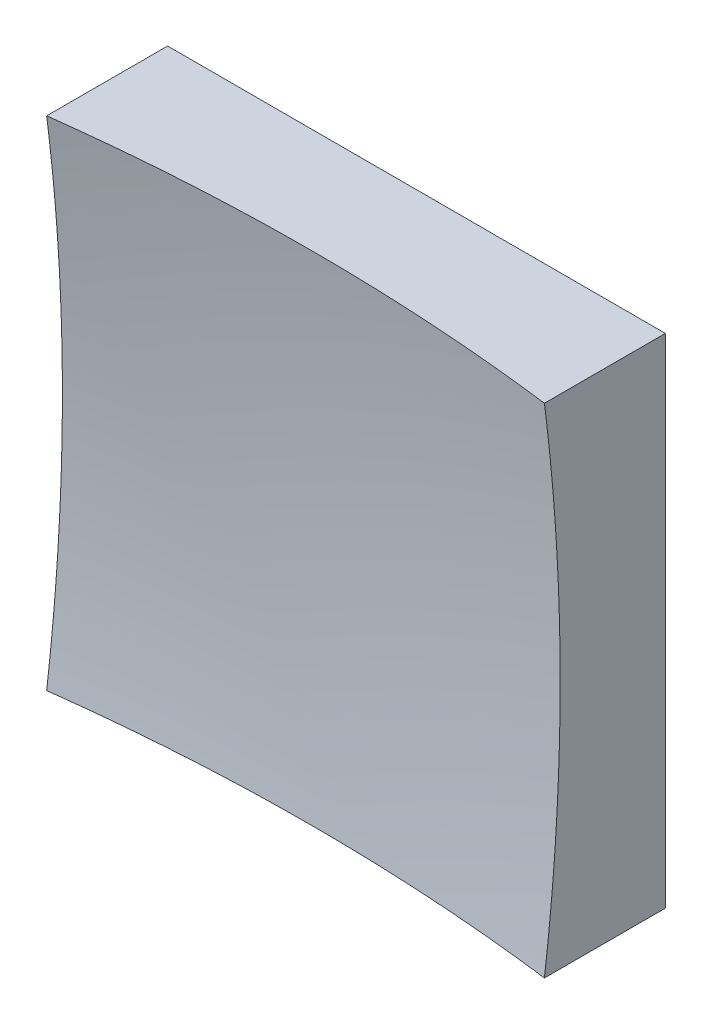
ISO-10303-21;
HEADER;
FILE_DESCRIPTION(('STEP AP214'),'2;1');
FILE_NAME('part.step','',(''),(''),'','','');
FILE_SCHEMA(('AUTOMOTIVE_DESIGN { 1 0 10303 214 1 1 1 1 }'));
ENDSEC;
DATA;
#1=APPLICATION_CONTEXT('core data for automotive mechanical design processes');
#2=APPLICATION_PROTOCOL_DEFINITION('international standard','automotive_design',2000,#1);
#3=PRODUCT_CONTEXT('',#1,'mechanical');
#4=PRODUCT('Part','Part','',(#3));
#5=PRODUCT_RELATED_PRODUCT_CATEGORY('part','',(#4));
#6=PRODUCT_DEFINITION_FORMATION('','',#4);
#7=PRODUCT_DEFINITION_CONTEXT('part definition',#1,'design');
#8=PRODUCT_DEFINITION('design','',#6,#7);
#9=PRODUCT_DEFINITION_SHAPE('','',#8);
#10=(LENGTH_UNIT() NAMED_UNIT(*) SI_UNIT(.MILLI.,.METRE.));
#11=(NAMED_UNIT(*) PLANE_ANGLE_UNIT() SI_UNIT($,.RADIAN.));
#12=(NAMED_UNIT(*) SI_UNIT($,.STERADIAN.) SOLID_ANGLE_UNIT());
#13=UNCERTAINTY_MEASURE_WITH_UNIT(LENGTH_MEASURE(1.E-05),#10,'distance_accuracy_value','');
#14=(GEOMETRIC_REPRESENTATION_CONTEXT(3) GLOBAL_UNCERTAINTY_ASSIGNED_CONTEXT((#13)) GLOBAL_UNIT_ASSIGNED_CONTEXT((#10,
#11,#12)) REPRESENTATION_CONTEXT('',''));
#15=CARTESIAN_POINT('',(0.,0.,0.));
#16=DIRECTION('',(0.,0.,1.));
#17=DIRECTION('',(1.,0.,0.));
#18=AXIS2_PLACEMENT_3D('',#15,#16,#17);
#19=CARTESIAN_POINT('',(-25.,25.,50.));
#20=DIRECTION('',(0.,1.,0.));
#21=DIRECTION('',(0.,0.,1.));
#22=AXIS2_PLACEMENT_3D('',#19,#20,#21);
#23=PLANE('',#22);
#24=CARTESIAN_POINT('',(0.,25.,209.));
#25=DIRECTION('',(0.,1.,0.));
#26=DIRECTION('',(0.,0.,1.));
#27=AXIS2_PLACEMENT_3D('',#24,#25,#26);
#28=CIRCLE('',#27,198.431348329844);
#29=CARTESIAN_POINT('',(25.,25.,12.1498031497047));
#30=VERTEX_POINT('',#29);
#31=CARTESIAN_POINT('',(-25.,25.,12.1498031497047));
#32=VERTEX_POINT('',#31);
#33=EDGE_CURVE('E79',#30,#32,#28,.T.);
#34=ORIENTED_EDGE('',*,*,#33,.F.);
#35=DIRECTION('',(0.,0.,-1.));
#36=VECTOR('',#35,1.);
#37=CARTESIAN_POINT('',(25.,25.,50.));
#38=LINE('',#37,#36);
#39=CARTESIAN_POINT('',(25.,25.,0.));
#40=VERTEX_POINT('',#39);
#41=EDGE_CURVE('E85',#30,#40,#38,.T.);
#42=ORIENTED_EDGE('',*,*,#41,.T.);
#43=DIRECTION('',(1.,0.,0.));
#44=VECTOR('',#43,1.);
#45=CARTESIAN_POINT('',(-25.,25.,0.));
#46=LINE('',#45,#44);
#47=CARTESIAN_POINT('',(-25.,25.,0.));
#48=VERTEX_POINT('',#47);
#49=EDGE_CURVE('E88',#48,#40,#46,.T.);
#50=ORIENTED_EDGE('',*,*,#49,.F.);
#51=DIRECTION('',(0.,0.,-1.));
#52=VECTOR('',#51,1.);
#53=CARTESIAN_POINT('',(-25.,25.,50.));
#54=LINE('',#53,#52);
#55=EDGE_CURVE('E47',#32,#48,#54,.T.);
#56=ORIENTED_EDGE('',*,*,#55,.F.);
#57=EDGE_LOOP('',(#34,#42,#50,#56));
#58=FACE_BOUND('',#57,.T.);
#59=ADVANCED_FACE('F39',(#58),#23,.T.);
#60=CARTESIAN_POINT('',(-25.,25.,50.));
#61=DIRECTION('',(1.,0.,0.));
#62=DIRECTION('',(0.,1.,0.));
#63=AXIS2_PLACEMENT_3D('',#60,#61,#62);
#64=PLANE('',#63);
#65=DIRECTION('',(0.,0.,-1.));
#66=VECTOR('',#65,1.);
#67=CARTESIAN_POINT('',(-25.,-25.,50.));
#68=LINE('',#67,#66);
#69=CARTESIAN_POINT('',(-25.,-25.,12.1498031497047));
#70=VERTEX_POINT('',#69);
#71=CARTESIAN_POINT('',(-25.,-25.,0.));
#72=VERTEX_POINT('',#71);
#73=EDGE_CURVE('E100',#70,#72,#68,.T.);
#74=ORIENTED_EDGE('',*,*,#73,.F.);
#75=CARTESIAN_POINT('',(-25.,0.,209.));
#76=DIRECTION('',(1.,0.,0.));
#77=DIRECTION('',(0.,1.,0.));
#78=AXIS2_PLACEMENT_3D('',#75,#76,#77);
#79=CIRCLE('',#78,198.431348329844);
#80=EDGE_CURVE('E89',#70,#32,#79,.T.);
#81=ORIENTED_EDGE('',*,*,#80,.T.);
#82=ORIENTED_EDGE('',*,*,#55,.T.);
#83=DIRECTION('',(0.,-1.,0.));
#84=VECTOR('',#83,1.);
#85=CARTESIAN_POINT('',(-25.,25.,0.));
#86=LINE('',#85,#84);
#87=EDGE_CURVE('E97',#48,#72,#86,.T.);
#88=ORIENTED_EDGE('',*,*,#87,.T.);
#89=EDGE_LOOP('',(#74,#81,#82,#88));
#90=FACE_BOUND('',#89,.T.);
#91=ADVANCED_FACE('F122',(#90),#64,.F.);
#92=CARTESIAN_POINT('',(-25.,-25.,50.));
#93=DIRECTION('',(0.,1.,0.));
#94=DIRECTION('',(0.,0.,1.));
#95=AXIS2_PLACEMENT_3D('',#92,#93,#94);
#96=PLANE('',#95);
#97=DIRECTION('',(0.,0.,-1.));
#98=VECTOR('',#97,1.);
#99=CARTESIAN_POINT('',(25.,-25.,50.));
#100=LINE('',#99,#98);
#101=CARTESIAN_POINT('',(25.,-25.,12.1498031497047));
#102=VERTEX_POINT('',#101);
#103=CARTESIAN_POINT('',(25.,-25.,0.));
#104=VERTEX_POINT('',#103);
#105=EDGE_CURVE('E96',#102,#104,#100,.T.);
#106=ORIENTED_EDGE('',*,*,#105,.F.);
#107=CARTESIAN_POINT('',(0.,-25.,209.));
#108=DIRECTION('',(0.,1.,0.));
#109=DIRECTION('',(0.,0.,1.));
#110=AXIS2_PLACEMENT_3D('',#107,#108,#109);
#111=CIRCLE('',#110,198.431348329844);
#112=EDGE_CURVE('E53',#102,#70,#111,.T.);
#113=ORIENTED_EDGE('',*,*,#112,.T.);
#114=ORIENTED_EDGE('',*,*,#73,.T.);
#115=DIRECTION('',(1.,0.,0.));
#116=VECTOR('',#115,1.);
#117=CARTESIAN_POINT('',(-25.,-25.,0.));
#118=LINE('',#117,#116);
#119=EDGE_CURVE('E102',#72,#104,#118,.T.);
#120=ORIENTED_EDGE('',*,*,#119,.T.);
#121=EDGE_LOOP('',(#106,#113,#114,#120));
#122=FACE_BOUND('',#121,.T.);
#123=ADVANCED_FACE('F121',(#122),#96,.F.);
#124=CARTESIAN_POINT('',(25.,25.,50.));
#125=DIRECTION('',(1.,0.,0.));
#126=DIRECTION('',(0.,1.,0.));
#127=AXIS2_PLACEMENT_3D('',#124,#125,#126);
#128=PLANE('',#127);
#129=CARTESIAN_POINT('',(25.,0.,209.));
#130=DIRECTION('',(1.,0.,0.));
#131=DIRECTION('',(0.,1.,0.));
#132=AXIS2_PLACEMENT_3D('',#129,#130,#131);
#133=CIRCLE('',#132,198.431348329844);
#134=EDGE_CURVE('E11',#102,#30,#133,.T.);
#135=ORIENTED_EDGE('',*,*,#134,.F.);
#136=ORIENTED_EDGE('',*,*,#105,.T.);
#137=DIRECTION('',(0.,-1.,0.));
#138=VECTOR('',#137,1.);
#139=CARTESIAN_POINT('',(25.,25.,0.));
#140=LINE('',#139,#138);
#141=EDGE_CURVE('E93',#40,#104,#140,.T.);
#142=ORIENTED_EDGE('',*,*,#141,.F.);
#143=ORIENTED_EDGE('',*,*,#41,.F.);
#144=EDGE_LOOP('',(#135,#136,#142,#143));
#145=FACE_BOUND('',#144,.T.);
#146=ADVANCED_FACE('F91',(#145),#128,.T.);
#147=CARTESIAN_POINT('',(0.,0.,0.));
#148=DIRECTION('',(0.,0.,-1.));
#149=DIRECTION('',(-1.,0.,0.));
#150=AXIS2_PLACEMENT_3D('',#147,#148,#149);
#151=PLANE('',#150);
#152=ORIENTED_EDGE('',*,*,#49,.T.);
#153=ORIENTED_EDGE('',*,*,#141,.T.);
#154=ORIENTED_EDGE('',*,*,#119,.F.);
#155=ORIENTED_EDGE('',*,*,#87,.F.);
#156=EDGE_LOOP('',(#152,#153,#154,#155));
#157=FACE_BOUND('',#156,.T.);
#158=ADVANCED_FACE('F125',(#157),#151,.T.);
#159=CARTESIAN_POINT('',(0.,0.,209.));
#160=DIRECTION('',(0.,0.,1.));
#161=DIRECTION('',(1.,0.,0.));
#162=AXIS2_PLACEMENT_3D('',#159,#160,#161);
#163=SPHERICAL_SURFACE('',#162,200.);
#164=ORIENTED_EDGE('',*,*,#33,.T.);
#165=ORIENTED_EDGE('',*,*,#80,.F.);
#166=ORIENTED_EDGE('',*,*,#112,.F.);
#167=ORIENTED_EDGE('',*,*,#134,.T.);
#168=EDGE_LOOP('',(#164,#165,#166,#167));
#169=FACE_BOUND('',#168,.T.);
#170=ADVANCED_FACE('F78',(#169),#163,.F.);
#171=CLOSED_SHELL('',(#59,#91,#123,#146,#158,#170));
#172=MANIFOLD_SOLID_BREP('B2',#171);
#173=ADVANCED_BREP_SHAPE_REPRESENTATION('',(#18,#172),#14);
#174=SHAPE_DEFINITION_REPRESENTATION(#9,#173);
ENDSEC;
END-ISO-10303-21;
